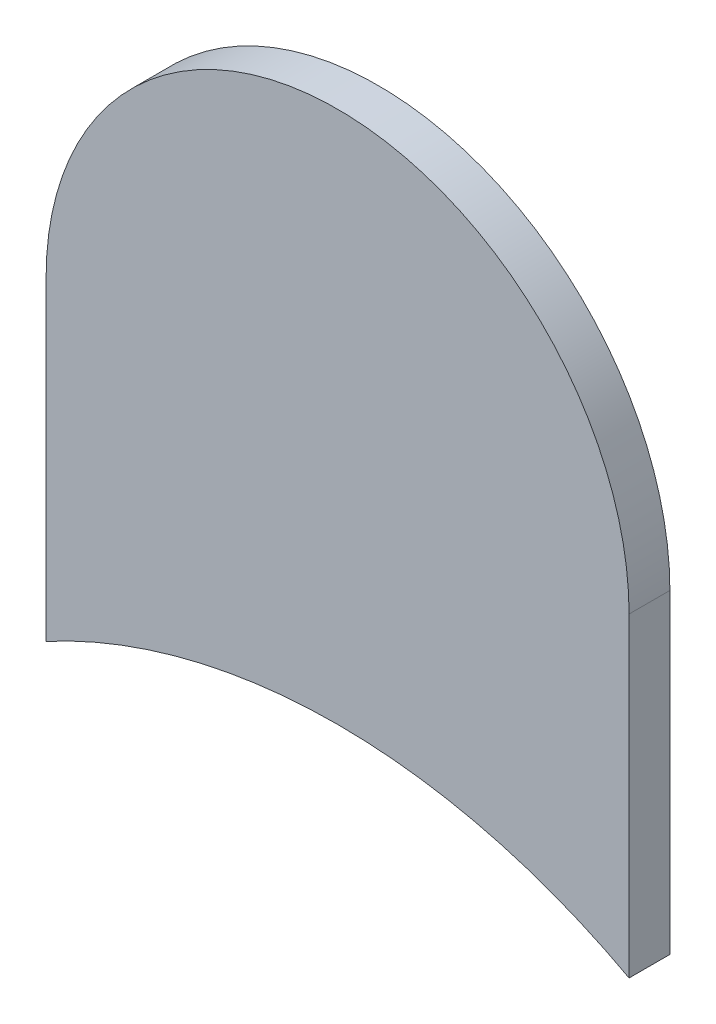
ISO-10303-21;
HEADER;
FILE_DESCRIPTION(('STEP AP214'),'2;1');
FILE_NAME('part.step','',(''),(''),'','','');
FILE_SCHEMA(('AUTOMOTIVE_DESIGN { 1 0 10303 214 1 1 1 1 }'));
ENDSEC;
DATA;
#1=APPLICATION_CONTEXT('core data for automotive mechanical design processes');
#2=APPLICATION_PROTOCOL_DEFINITION('international standard','automotive_design',2000,#1);
#3=PRODUCT_CONTEXT('',#1,'mechanical');
#4=PRODUCT('Part','Part','',(#3));
#5=PRODUCT_RELATED_PRODUCT_CATEGORY('part','',(#4));
#6=PRODUCT_DEFINITION_FORMATION('','',#4);
#7=PRODUCT_DEFINITION_CONTEXT('part definition',#1,'design');
#8=PRODUCT_DEFINITION('design','',#6,#7);
#9=PRODUCT_DEFINITION_SHAPE('','',#8);
#10=(LENGTH_UNIT() NAMED_UNIT(*) SI_UNIT(.MILLI.,.METRE.));
#11=(NAMED_UNIT(*) PLANE_ANGLE_UNIT() SI_UNIT($,.RADIAN.));
#12=(NAMED_UNIT(*) SI_UNIT($,.STERADIAN.) SOLID_ANGLE_UNIT());
#13=UNCERTAINTY_MEASURE_WITH_UNIT(LENGTH_MEASURE(1.E-05),#10,'distance_accuracy_value','');
#14=(GEOMETRIC_REPRESENTATION_CONTEXT(3) GLOBAL_UNCERTAINTY_ASSIGNED_CONTEXT((#13)) GLOBAL_UNIT_ASSIGNED_CONTEXT((#10,
#11,#12)) REPRESENTATION_CONTEXT('',''));
#15=CARTESIAN_POINT('',(0.,0.,0.));
#16=DIRECTION('',(0.,0.,1.));
#17=DIRECTION('',(1.,0.,0.));
#18=AXIS2_PLACEMENT_3D('',#15,#16,#17);
#19=CARTESIAN_POINT('',(136.652,-111.002,-0.035));
#20=DIRECTION('',(1.,0.,0.));
#21=DIRECTION('',(0.,1.,0.));
#22=AXIS2_PLACEMENT_3D('',#19,#20,#21);
#23=PLANE('',#22);
#24=DIRECTION('',(0.,0.,-1.));
#25=VECTOR('',#24,1.);
#26=CARTESIAN_POINT('',(136.652,-111.2723453671,-0.045));
#27=LINE('',#26,#25);
#28=CARTESIAN_POINT('',(136.652,-111.2723453671,0.));
#29=VERTEX_POINT('',#28);
#30=CARTESIAN_POINT('',(136.652,-111.2723453671,-0.035));
#31=VERTEX_POINT('',#30);
#32=EDGE_CURVE('E11',#29,#31,#27,.T.);
#33=ORIENTED_EDGE('',*,*,#32,.F.);
#34=DIRECTION('',(0.,-1.,0.));
#35=VECTOR('',#34,1.);
#36=CARTESIAN_POINT('',(136.652,-111.002,0.));
#37=LINE('',#36,#35);
#38=CARTESIAN_POINT('',(136.652,-111.002,0.));
#39=VERTEX_POINT('',#38);
#40=EDGE_CURVE('E20',#39,#29,#37,.T.);
#41=ORIENTED_EDGE('',*,*,#40,.F.);
#42=DIRECTION('',(0.,0.,1.));
#43=VECTOR('',#42,1.);
#44=CARTESIAN_POINT('',(136.652,-111.002,-0.035));
#45=LINE('',#44,#43);
#46=CARTESIAN_POINT('',(136.652,-111.002,-0.035));
#47=VERTEX_POINT('',#46);
#48=EDGE_CURVE('E103',#47,#39,#45,.T.);
#49=ORIENTED_EDGE('',*,*,#48,.F.);
#50=DIRECTION('',(0.,-1.,0.));
#51=VECTOR('',#50,1.);
#52=CARTESIAN_POINT('',(136.652,-111.002,-0.035));
#53=LINE('',#52,#51);
#54=EDGE_CURVE('E75',#47,#31,#53,.T.);
#55=ORIENTED_EDGE('',*,*,#54,.T.);
#56=EDGE_LOOP('',(#33,#41,#49,#55));
#57=FACE_BOUND('',#56,.T.);
#58=ADVANCED_FACE('F17',(#57),#23,.F.);
#59=CARTESIAN_POINT('',(136.902,-111.734,-0.045));
#60=DIRECTION('',(0.,0.,-1.));
#61=DIRECTION('',(0.,-1.,0.));
#62=AXIS2_PLACEMENT_3D('',#59,#60,#61);
#63=CYLINDRICAL_SURFACE('',#62,0.525);
#64=DIRECTION('',(0.,0.,-1.));
#65=VECTOR('',#64,1.);
#66=CARTESIAN_POINT('',(137.152,-111.2723453671,-0.045));
#67=LINE('',#66,#65);
#68=CARTESIAN_POINT('',(137.152,-111.2723453671,0.));
#69=VERTEX_POINT('',#68);
#70=CARTESIAN_POINT('',(137.152,-111.2723453671,-0.035));
#71=VERTEX_POINT('',#70);
#72=EDGE_CURVE('E88',#69,#71,#67,.T.);
#73=ORIENTED_EDGE('',*,*,#72,.F.);
#74=CARTESIAN_POINT('',(136.902,-111.734,0.));
#75=DIRECTION('',(0.,0.,-1.));
#76=DIRECTION('',(0.,-1.,0.));
#77=AXIS2_PLACEMENT_3D('',#74,#75,#76);
#78=CIRCLE('',#77,0.525);
#79=EDGE_CURVE('E110',#29,#69,#78,.T.);
#80=ORIENTED_EDGE('',*,*,#79,.F.);
#81=ORIENTED_EDGE('',*,*,#32,.T.);
#82=CARTESIAN_POINT('',(136.902,-111.734,-0.035));
#83=DIRECTION('',(0.,0.,-1.));
#84=DIRECTION('',(0.,-1.,0.));
#85=AXIS2_PLACEMENT_3D('',#82,#83,#84);
#86=CIRCLE('',#85,0.525);
#87=EDGE_CURVE('E80',#31,#71,#86,.T.);
#88=ORIENTED_EDGE('',*,*,#87,.T.);
#89=EDGE_LOOP('',(#73,#80,#81,#88));
#90=FACE_BOUND('',#89,.T.);
#91=ADVANCED_FACE('F124',(#90),#63,.F.);
#92=CARTESIAN_POINT('',(137.152,-111.734,0.));
#93=DIRECTION('',(0.,0.,1.));
#94=DIRECTION('',(1.,0.,0.));
#95=AXIS2_PLACEMENT_3D('',#92,#93,#94);
#96=PLANE('',#95);
#97=ORIENTED_EDGE('',*,*,#79,.T.);
#98=DIRECTION('',(0.,1.,0.));
#99=VECTOR('',#98,1.);
#100=CARTESIAN_POINT('',(137.152,-111.734,0.));
#101=LINE('',#100,#99);
#102=CARTESIAN_POINT('',(137.152,-111.002,0.));
#103=VERTEX_POINT('',#102);
#104=EDGE_CURVE('E95',#69,#103,#101,.T.);
#105=ORIENTED_EDGE('',*,*,#104,.T.);
#106=CARTESIAN_POINT('',(136.902,-111.002,0.));
#107=DIRECTION('',(0.,0.,1.));
#108=DIRECTION('',(1.,0.,0.));
#109=AXIS2_PLACEMENT_3D('',#106,#107,#108);
#110=CIRCLE('',#109,0.25);
#111=EDGE_CURVE('E92',#103,#39,#110,.T.);
#112=ORIENTED_EDGE('',*,*,#111,.T.);
#113=ORIENTED_EDGE('',*,*,#40,.T.);
#114=EDGE_LOOP('',(#97,#105,#112,#113));
#115=FACE_BOUND('',#114,.T.);
#116=ADVANCED_FACE('F122',(#115),#96,.T.);
#117=CARTESIAN_POINT('',(136.902,-111.002,-0.035));
#118=DIRECTION('',(0.,0.,-1.));
#119=DIRECTION('',(1.,0.,0.));
#120=AXIS2_PLACEMENT_3D('',#117,#118,#119);
#121=CYLINDRICAL_SURFACE('',#120,0.25);
#122=CARTESIAN_POINT('',(136.902,-111.002,-0.035));
#123=DIRECTION('',(0.,0.,1.));
#124=DIRECTION('',(1.,0.,0.));
#125=AXIS2_PLACEMENT_3D('',#122,#123,#124);
#126=CIRCLE('',#125,0.25);
#127=CARTESIAN_POINT('',(137.152,-111.002,-0.035));
#128=VERTEX_POINT('',#127);
#129=EDGE_CURVE('E69',#128,#47,#126,.T.);
#130=ORIENTED_EDGE('',*,*,#129,.T.);
#131=ORIENTED_EDGE('',*,*,#48,.T.);
#132=ORIENTED_EDGE('',*,*,#111,.F.);
#133=DIRECTION('',(0.,0.,1.));
#134=VECTOR('',#133,1.);
#135=CARTESIAN_POINT('',(137.152,-111.002,-0.035));
#136=LINE('',#135,#134);
#137=EDGE_CURVE('E86',#128,#103,#136,.T.);
#138=ORIENTED_EDGE('',*,*,#137,.F.);
#139=EDGE_LOOP('',(#130,#131,#132,#138));
#140=FACE_BOUND('',#139,.T.);
#141=ADVANCED_FACE('F91',(#140),#121,.T.);
#142=CARTESIAN_POINT('',(137.152,-111.734,-0.035));
#143=DIRECTION('',(0.,0.,1.));
#144=DIRECTION('',(1.,0.,0.));
#145=AXIS2_PLACEMENT_3D('',#142,#143,#144);
#146=PLANE('',#145);
#147=ORIENTED_EDGE('',*,*,#54,.F.);
#148=ORIENTED_EDGE('',*,*,#129,.F.);
#149=DIRECTION('',(0.,1.,0.));
#150=VECTOR('',#149,1.);
#151=CARTESIAN_POINT('',(137.152,-111.734,-0.035));
#152=LINE('',#151,#150);
#153=EDGE_CURVE('E73',#71,#128,#152,.T.);
#154=ORIENTED_EDGE('',*,*,#153,.F.);
#155=ORIENTED_EDGE('',*,*,#87,.F.);
#156=EDGE_LOOP('',(#147,#148,#154,#155));
#157=FACE_BOUND('',#156,.T.);
#158=ADVANCED_FACE('F71',(#157),#146,.F.);
#159=CARTESIAN_POINT('',(137.152,-111.734,-0.035));
#160=DIRECTION('',(-1.,0.,0.));
#161=DIRECTION('',(0.,0.,1.));
#162=AXIS2_PLACEMENT_3D('',#159,#160,#161);
#163=PLANE('',#162);
#164=ORIENTED_EDGE('',*,*,#137,.T.);
#165=ORIENTED_EDGE('',*,*,#104,.F.);
#166=ORIENTED_EDGE('',*,*,#72,.T.);
#167=ORIENTED_EDGE('',*,*,#153,.T.);
#168=EDGE_LOOP('',(#164,#165,#166,#167));
#169=FACE_BOUND('',#168,.T.);
#170=ADVANCED_FACE('F84',(#169),#163,.F.);
#171=CLOSED_SHELL('',(#58,#91,#116,#141,#158,#170));
#172=MANIFOLD_SOLID_BREP('B1',#171);
#173=ADVANCED_BREP_SHAPE_REPRESENTATION('',(#18,#172),#14);
#174=SHAPE_DEFINITION_REPRESENTATION(#9,#173);
ENDSEC;
END-ISO-10303-21;
